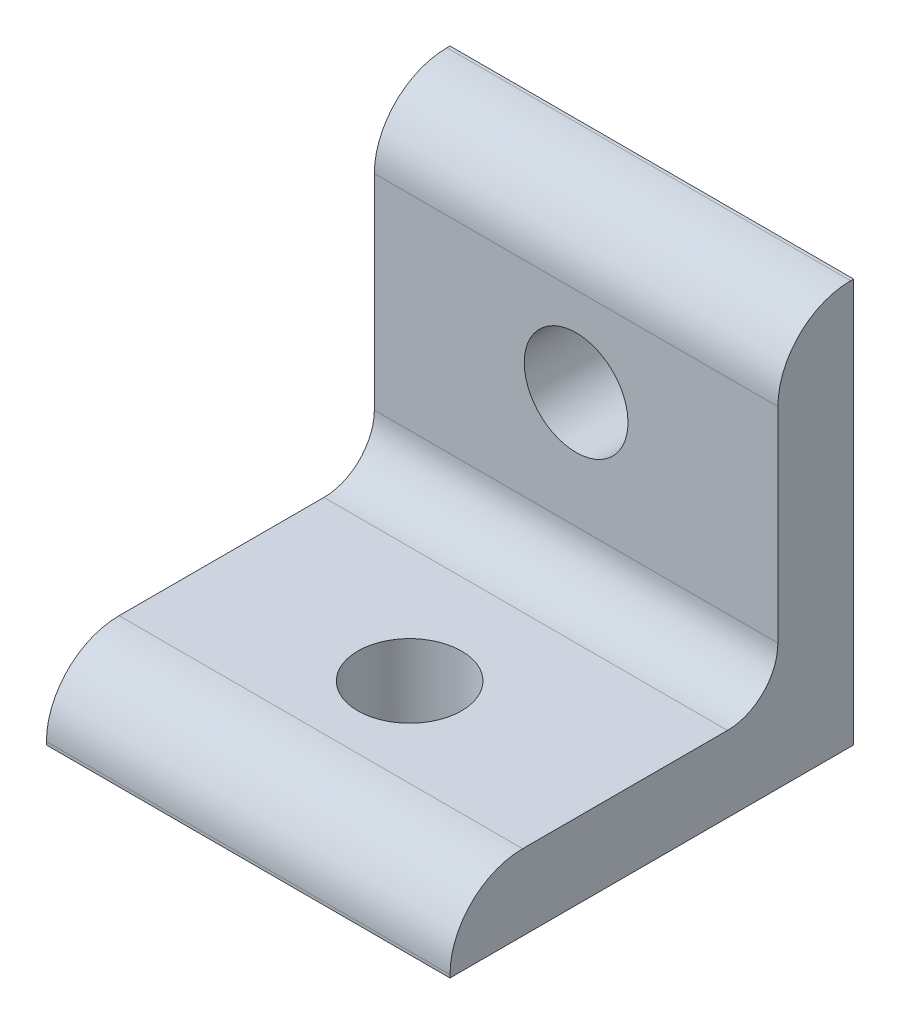
ISO-10303-21;
HEADER;
FILE_DESCRIPTION(('STEP AP214'),'2;1');
FILE_NAME('part.step','',(''),(''),'','','');
FILE_SCHEMA(('AUTOMOTIVE_DESIGN { 1 0 10303 214 1 1 1 1 }'));
ENDSEC;
DATA;
#1=APPLICATION_CONTEXT('core data for automotive mechanical design processes');
#2=APPLICATION_PROTOCOL_DEFINITION('international standard','automotive_design',2000,#1);
#3=PRODUCT_CONTEXT('',#1,'mechanical');
#4=PRODUCT('Part','Part','',(#3));
#5=PRODUCT_RELATED_PRODUCT_CATEGORY('part','',(#4));
#6=PRODUCT_DEFINITION_FORMATION('','',#4);
#7=PRODUCT_DEFINITION_CONTEXT('part definition',#1,'design');
#8=PRODUCT_DEFINITION('design','',#6,#7);
#9=PRODUCT_DEFINITION_SHAPE('','',#8);
#10=(LENGTH_UNIT() NAMED_UNIT(*) SI_UNIT(.MILLI.,.METRE.));
#11=(NAMED_UNIT(*) PLANE_ANGLE_UNIT() SI_UNIT($,.RADIAN.));
#12=(NAMED_UNIT(*) SI_UNIT($,.STERADIAN.) SOLID_ANGLE_UNIT());
#13=UNCERTAINTY_MEASURE_WITH_UNIT(LENGTH_MEASURE(1.E-05),#10,'distance_accuracy_value','');
#14=(GEOMETRIC_REPRESENTATION_CONTEXT(3) GLOBAL_UNCERTAINTY_ASSIGNED_CONTEXT((#13)) GLOBAL_UNIT_ASSIGNED_CONTEXT((#10,
#11,#12)) REPRESENTATION_CONTEXT('',''));
#15=CARTESIAN_POINT('',(0.,0.,0.));
#16=DIRECTION('',(0.,0.,1.));
#17=DIRECTION('',(1.,0.,0.));
#18=AXIS2_PLACEMENT_3D('',#15,#16,#17);
#19=CARTESIAN_POINT('',(25.4,25.4,0.));
#20=DIRECTION('',(0.,0.,-1.));
#21=DIRECTION('',(-1.,0.,0.));
#22=AXIS2_PLACEMENT_3D('',#19,#20,#21);
#23=PLANE('',#22);
#24=CARTESIAN_POINT('',(12.7,15.24,0.));
#25=DIRECTION('',(0.,0.,-1.));
#26=DIRECTION('',(-1.,0.,0.));
#27=AXIS2_PLACEMENT_3D('',#24,#25,#26);
#28=CIRCLE('',#27,3.2639);
#29=CARTESIAN_POINT('',(9.4361,15.24,0.));
#30=VERTEX_POINT('',#29);
#31=EDGE_CURVE('E219',#30,#30,#28,.T.);
#32=ORIENTED_EDGE('',*,*,#31,.F.);
#33=EDGE_LOOP('',(#32));
#34=FACE_BOUND('',#33,.T.);
#35=DIRECTION('',(0.,-1.,0.));
#36=VECTOR('',#35,1.);
#37=CARTESIAN_POINT('',(0.,25.4,0.));
#38=LINE('',#37,#36);
#39=CARTESIAN_POINT('',(0.,25.4,0.));
#40=VERTEX_POINT('',#39);
#41=CARTESIAN_POINT('',(0.,0.,0.));
#42=VERTEX_POINT('',#41);
#43=EDGE_CURVE('E139',#40,#42,#38,.T.);
#44=ORIENTED_EDGE('',*,*,#43,.F.);
#45=DIRECTION('',(-1.,0.,0.));
#46=VECTOR('',#45,1.);
#47=CARTESIAN_POINT('',(25.4,25.4,0.));
#48=LINE('',#47,#46);
#49=CARTESIAN_POINT('',(25.4,25.4,0.));
#50=VERTEX_POINT('',#49);
#51=EDGE_CURVE('E11',#50,#40,#48,.T.);
#52=ORIENTED_EDGE('',*,*,#51,.F.);
#53=DIRECTION('',(0.,-1.,0.));
#54=VECTOR('',#53,1.);
#55=CARTESIAN_POINT('',(25.4,25.4,0.));
#56=LINE('',#55,#54);
#57=CARTESIAN_POINT('',(25.4,0.,0.));
#58=VERTEX_POINT('',#57);
#59=EDGE_CURVE('E163',#50,#58,#56,.T.);
#60=ORIENTED_EDGE('',*,*,#59,.T.);
#61=DIRECTION('',(-1.,0.,0.));
#62=VECTOR('',#61,1.);
#63=CARTESIAN_POINT('',(25.4,0.,0.));
#64=LINE('',#63,#62);
#65=EDGE_CURVE('E39',#58,#42,#64,.T.);
#66=ORIENTED_EDGE('',*,*,#65,.T.);
#67=EDGE_LOOP('',(#44,#52,#60,#66));
#68=FACE_BOUND('',#67,.T.);
#69=ADVANCED_FACE('F36',(#34,#68),#23,.T.);
#70=CARTESIAN_POINT('',(25.4,25.4,0.));
#71=DIRECTION('',(0.,1.,0.));
#72=DIRECTION('',(0.,0.,1.));
#73=AXIS2_PLACEMENT_3D('',#70,#71,#72);
#74=PLANE('',#73);
#75=DIRECTION('',(0.,0.,-1.));
#76=VECTOR('',#75,1.);
#77=CARTESIAN_POINT('',(0.,25.4,0.));
#78=LINE('',#77,#76);
#79=CARTESIAN_POINT('',(0.,25.4,0.190499999999996));
#80=VERTEX_POINT('',#79);
#81=EDGE_CURVE('E161',#80,#40,#78,.T.);
#82=ORIENTED_EDGE('',*,*,#81,.F.);
#83=DIRECTION('',(-1.,0.,0.));
#84=VECTOR('',#83,1.);
#85=CARTESIAN_POINT('',(25.4,25.4,0.190499999999996));
#86=LINE('',#85,#84);
#87=CARTESIAN_POINT('',(25.4,25.4,0.190499999999996));
#88=VERTEX_POINT('',#87);
#89=EDGE_CURVE('E45',#88,#80,#86,.T.);
#90=ORIENTED_EDGE('',*,*,#89,.F.);
#91=DIRECTION('',(0.,0.,-1.));
#92=VECTOR('',#91,1.);
#93=CARTESIAN_POINT('',(25.4,25.4,0.));
#94=LINE('',#93,#92);
#95=EDGE_CURVE('E129',#88,#50,#94,.T.);
#96=ORIENTED_EDGE('',*,*,#95,.T.);
#97=ORIENTED_EDGE('',*,*,#51,.T.);
#98=EDGE_LOOP('',(#82,#90,#96,#97));
#99=FACE_BOUND('',#98,.T.);
#100=ADVANCED_FACE('F177',(#99),#74,.T.);
#101=CARTESIAN_POINT('',(25.4,20.828,0.190499999999996));
#102=DIRECTION('',(-1.,0.,0.));
#103=DIRECTION('',(0.,0.,1.));
#104=AXIS2_PLACEMENT_3D('',#101,#102,#103);
#105=CYLINDRICAL_SURFACE('',#104,4.572);
#106=CARTESIAN_POINT('',(0.,20.828,0.190499999999996));
#107=DIRECTION('',(-1.,0.,0.));
#108=DIRECTION('',(0.,0.,1.));
#109=AXIS2_PLACEMENT_3D('',#106,#107,#108);
#110=CIRCLE('',#109,4.572);
#111=CARTESIAN_POINT('',(0.,20.828,4.7625));
#112=VERTEX_POINT('',#111);
#113=EDGE_CURVE('E116',#112,#80,#110,.T.);
#114=ORIENTED_EDGE('',*,*,#113,.F.);
#115=DIRECTION('',(-1.,0.,0.));
#116=VECTOR('',#115,1.);
#117=CARTESIAN_POINT('',(25.4,20.828,4.7625));
#118=LINE('',#117,#116);
#119=CARTESIAN_POINT('',(25.4,20.828,4.7625));
#120=VERTEX_POINT('',#119);
#121=EDGE_CURVE('E111',#120,#112,#118,.T.);
#122=ORIENTED_EDGE('',*,*,#121,.F.);
#123=CARTESIAN_POINT('',(25.4,20.828,0.190499999999996));
#124=DIRECTION('',(-1.,0.,0.));
#125=DIRECTION('',(0.,0.,1.));
#126=AXIS2_PLACEMENT_3D('',#123,#124,#125);
#127=CIRCLE('',#126,4.572);
#128=EDGE_CURVE('E114',#120,#88,#127,.T.);
#129=ORIENTED_EDGE('',*,*,#128,.T.);
#130=ORIENTED_EDGE('',*,*,#89,.T.);
#131=EDGE_LOOP('',(#114,#122,#129,#130));
#132=FACE_BOUND('',#131,.T.);
#133=ADVANCED_FACE('F113',(#132),#105,.T.);
#134=CARTESIAN_POINT('',(25.4,7.9375,4.7625));
#135=DIRECTION('',(0.,0.,1.));
#136=DIRECTION('',(0.,-1.,0.));
#137=AXIS2_PLACEMENT_3D('',#134,#135,#136);
#138=PLANE('',#137);
#139=CARTESIAN_POINT('',(12.7,15.24,4.7625));
#140=DIRECTION('',(0.,0.,1.));
#141=DIRECTION('',(0.,-1.,0.));
#142=AXIS2_PLACEMENT_3D('',#139,#140,#141);
#143=CIRCLE('',#142,3.2639);
#144=CARTESIAN_POINT('',(12.7,11.9761,4.7625));
#145=VERTEX_POINT('',#144);
#146=EDGE_CURVE('E143',#145,#145,#143,.T.);
#147=ORIENTED_EDGE('',*,*,#146,.F.);
#148=EDGE_LOOP('',(#147));
#149=FACE_BOUND('',#148,.T.);
#150=DIRECTION('',(0.,1.,0.));
#151=VECTOR('',#150,1.);
#152=CARTESIAN_POINT('',(0.,7.9375,4.7625));
#153=LINE('',#152,#151);
#154=CARTESIAN_POINT('',(0.,7.9375,4.7625));
#155=VERTEX_POINT('',#154);
#156=EDGE_CURVE('E158',#155,#112,#153,.T.);
#157=ORIENTED_EDGE('',*,*,#156,.F.);
#158=DIRECTION('',(-1.,0.,0.));
#159=VECTOR('',#158,1.);
#160=CARTESIAN_POINT('',(25.4,7.9375,4.7625));
#161=LINE('',#160,#159);
#162=CARTESIAN_POINT('',(25.4,7.9375,4.7625));
#163=VERTEX_POINT('',#162);
#164=EDGE_CURVE('E121',#163,#155,#161,.T.);
#165=ORIENTED_EDGE('',*,*,#164,.F.);
#166=DIRECTION('',(0.,1.,0.));
#167=VECTOR('',#166,1.);
#168=CARTESIAN_POINT('',(25.4,7.9375,4.7625));
#169=LINE('',#168,#167);
#170=EDGE_CURVE('E127',#163,#120,#169,.T.);
#171=ORIENTED_EDGE('',*,*,#170,.T.);
#172=ORIENTED_EDGE('',*,*,#121,.T.);
#173=EDGE_LOOP('',(#157,#165,#171,#172));
#174=FACE_BOUND('',#173,.T.);
#175=ADVANCED_FACE('F131',(#149,#174),#138,.T.);
#176=CARTESIAN_POINT('',(25.4,7.9375,7.9375));
#177=DIRECTION('',(-1.,0.,0.));
#178=DIRECTION('',(0.,0.,1.));
#179=AXIS2_PLACEMENT_3D('',#176,#177,#178);
#180=CYLINDRICAL_SURFACE('',#179,3.175);
#181=CARTESIAN_POINT('',(0.,7.9375,7.9375));
#182=DIRECTION('',(1.,0.,0.));
#183=DIRECTION('',(0.,0.,-1.));
#184=AXIS2_PLACEMENT_3D('',#181,#182,#183);
#185=CIRCLE('',#184,3.175);
#186=CARTESIAN_POINT('',(0.,4.7625,7.9375));
#187=VERTEX_POINT('',#186);
#188=EDGE_CURVE('E155',#187,#155,#185,.T.);
#189=ORIENTED_EDGE('',*,*,#188,.F.);
#190=DIRECTION('',(-1.,0.,0.));
#191=VECTOR('',#190,1.);
#192=CARTESIAN_POINT('',(25.4,4.7625,7.9375));
#193=LINE('',#192,#191);
#194=CARTESIAN_POINT('',(25.4,4.7625,7.9375));
#195=VERTEX_POINT('',#194);
#196=EDGE_CURVE('E167',#195,#187,#193,.T.);
#197=ORIENTED_EDGE('',*,*,#196,.F.);
#198=CARTESIAN_POINT('',(25.4,7.9375,7.9375));
#199=DIRECTION('',(1.,0.,0.));
#200=DIRECTION('',(0.,0.,-1.));
#201=AXIS2_PLACEMENT_3D('',#198,#199,#200);
#202=CIRCLE('',#201,3.175);
#203=EDGE_CURVE('E132',#195,#163,#202,.T.);
#204=ORIENTED_EDGE('',*,*,#203,.T.);
#205=ORIENTED_EDGE('',*,*,#164,.T.);
#206=EDGE_LOOP('',(#189,#197,#204,#205));
#207=FACE_BOUND('',#206,.T.);
#208=ADVANCED_FACE('F191',(#207),#180,.F.);
#209=CARTESIAN_POINT('',(25.4,4.7625,20.828));
#210=DIRECTION('',(0.,1.,0.));
#211=DIRECTION('',(0.,0.,1.));
#212=AXIS2_PLACEMENT_3D('',#209,#210,#211);
#213=PLANE('',#212);
#214=CARTESIAN_POINT('',(12.7,4.7625,15.24));
#215=DIRECTION('',(0.,1.,0.));
#216=DIRECTION('',(0.,0.,1.));
#217=AXIS2_PLACEMENT_3D('',#214,#215,#216);
#218=CIRCLE('',#217,3.26389999999999);
#219=CARTESIAN_POINT('',(12.7,4.7625,18.5039));
#220=VERTEX_POINT('',#219);
#221=EDGE_CURVE('E216',#220,#220,#218,.T.);
#222=ORIENTED_EDGE('',*,*,#221,.F.);
#223=EDGE_LOOP('',(#222));
#224=FACE_BOUND('',#223,.T.);
#225=DIRECTION('',(0.,0.,-1.));
#226=VECTOR('',#225,1.);
#227=CARTESIAN_POINT('',(0.,4.7625,20.828));
#228=LINE('',#227,#226);
#229=CARTESIAN_POINT('',(0.,4.7625,20.828));
#230=VERTEX_POINT('',#229);
#231=EDGE_CURVE('E152',#230,#187,#228,.T.);
#232=ORIENTED_EDGE('',*,*,#231,.F.);
#233=DIRECTION('',(-1.,0.,0.));
#234=VECTOR('',#233,1.);
#235=CARTESIAN_POINT('',(25.4,4.7625,20.828));
#236=LINE('',#235,#234);
#237=CARTESIAN_POINT('',(25.4,4.7625,20.828));
#238=VERTEX_POINT('',#237);
#239=EDGE_CURVE('E169',#238,#230,#236,.T.);
#240=ORIENTED_EDGE('',*,*,#239,.F.);
#241=DIRECTION('',(0.,0.,-1.));
#242=VECTOR('',#241,1.);
#243=CARTESIAN_POINT('',(25.4,4.7625,20.828));
#244=LINE('',#243,#242);
#245=EDGE_CURVE('E134',#238,#195,#244,.T.);
#246=ORIENTED_EDGE('',*,*,#245,.T.);
#247=ORIENTED_EDGE('',*,*,#196,.T.);
#248=EDGE_LOOP('',(#232,#240,#246,#247));
#249=FACE_BOUND('',#248,.T.);
#250=ADVANCED_FACE('F195',(#224,#249),#213,.T.);
#251=CARTESIAN_POINT('',(25.4,0.1905,20.828));
#252=DIRECTION('',(-1.,0.,0.));
#253=DIRECTION('',(0.,0.,1.));
#254=AXIS2_PLACEMENT_3D('',#251,#252,#253);
#255=CYLINDRICAL_SURFACE('',#254,4.572);
#256=CARTESIAN_POINT('',(0.,0.1905,20.828));
#257=DIRECTION('',(-1.,0.,0.));
#258=DIRECTION('',(0.,0.,-1.));
#259=AXIS2_PLACEMENT_3D('',#256,#257,#258);
#260=CIRCLE('',#259,4.572);
#261=CARTESIAN_POINT('',(0.,0.1905,25.4));
#262=VERTEX_POINT('',#261);
#263=EDGE_CURVE('E149',#262,#230,#260,.T.);
#264=ORIENTED_EDGE('',*,*,#263,.F.);
#265=DIRECTION('',(-1.,0.,0.));
#266=VECTOR('',#265,1.);
#267=CARTESIAN_POINT('',(25.4,0.1905,25.4));
#268=LINE('',#267,#266);
#269=CARTESIAN_POINT('',(25.4,0.1905,25.4));
#270=VERTEX_POINT('',#269);
#271=EDGE_CURVE('E171',#270,#262,#268,.T.);
#272=ORIENTED_EDGE('',*,*,#271,.F.);
#273=CARTESIAN_POINT('',(25.4,0.1905,20.828));
#274=DIRECTION('',(-1.,0.,0.));
#275=DIRECTION('',(0.,0.,-1.));
#276=AXIS2_PLACEMENT_3D('',#273,#274,#275);
#277=CIRCLE('',#276,4.572);
#278=EDGE_CURVE('E232',#270,#238,#277,.T.);
#279=ORIENTED_EDGE('',*,*,#278,.T.);
#280=ORIENTED_EDGE('',*,*,#239,.T.);
#281=EDGE_LOOP('',(#264,#272,#279,#280));
#282=FACE_BOUND('',#281,.T.);
#283=ADVANCED_FACE('F199',(#282),#255,.T.);
#284=CARTESIAN_POINT('',(25.4,0.,25.4));
#285=DIRECTION('',(0.,0.,1.));
#286=DIRECTION('',(0.,-1.,0.));
#287=AXIS2_PLACEMENT_3D('',#284,#285,#286);
#288=PLANE('',#287);
#289=DIRECTION('',(0.,1.,0.));
#290=VECTOR('',#289,1.);
#291=CARTESIAN_POINT('',(0.,0.,25.4));
#292=LINE('',#291,#290);
#293=CARTESIAN_POINT('',(0.,0.,25.4));
#294=VERTEX_POINT('',#293);
#295=EDGE_CURVE('E146',#294,#262,#292,.T.);
#296=ORIENTED_EDGE('',*,*,#295,.F.);
#297=DIRECTION('',(-1.,0.,0.));
#298=VECTOR('',#297,1.);
#299=CARTESIAN_POINT('',(25.4,0.,25.4));
#300=LINE('',#299,#298);
#301=CARTESIAN_POINT('',(25.4,0.,25.4));
#302=VERTEX_POINT('',#301);
#303=EDGE_CURVE('E172',#302,#294,#300,.T.);
#304=ORIENTED_EDGE('',*,*,#303,.F.);
#305=DIRECTION('',(0.,1.,0.));
#306=VECTOR('',#305,1.);
#307=CARTESIAN_POINT('',(25.4,0.,25.4));
#308=LINE('',#307,#306);
#309=EDGE_CURVE('E229',#302,#270,#308,.T.);
#310=ORIENTED_EDGE('',*,*,#309,.T.);
#311=ORIENTED_EDGE('',*,*,#271,.T.);
#312=EDGE_LOOP('',(#296,#304,#310,#311));
#313=FACE_BOUND('',#312,.T.);
#314=ADVANCED_FACE('F203',(#313),#288,.T.);
#315=CARTESIAN_POINT('',(25.4,0.,0.));
#316=DIRECTION('',(0.,-1.,0.));
#317=DIRECTION('',(0.,0.,-1.));
#318=AXIS2_PLACEMENT_3D('',#315,#316,#317);
#319=PLANE('',#318);
#320=CARTESIAN_POINT('',(12.7,0.,15.24));
#321=DIRECTION('',(0.,-1.,0.));
#322=DIRECTION('',(0.,0.,-1.));
#323=AXIS2_PLACEMENT_3D('',#320,#321,#322);
#324=CIRCLE('',#323,3.26389999999999);
#325=CARTESIAN_POINT('',(12.7,0.,11.9761));
#326=VERTEX_POINT('',#325);
#327=EDGE_CURVE('E214',#326,#326,#324,.T.);
#328=ORIENTED_EDGE('',*,*,#327,.F.);
#329=EDGE_LOOP('',(#328));
#330=FACE_BOUND('',#329,.T.);
#331=DIRECTION('',(0.,0.,1.));
#332=VECTOR('',#331,1.);
#333=CARTESIAN_POINT('',(0.,0.,0.));
#334=LINE('',#333,#332);
#335=EDGE_CURVE('E142',#42,#294,#334,.T.);
#336=ORIENTED_EDGE('',*,*,#335,.F.);
#337=ORIENTED_EDGE('',*,*,#65,.F.);
#338=DIRECTION('',(0.,0.,1.));
#339=VECTOR('',#338,1.);
#340=CARTESIAN_POINT('',(25.4,0.,0.));
#341=LINE('',#340,#339);
#342=EDGE_CURVE('E227',#58,#302,#341,.T.);
#343=ORIENTED_EDGE('',*,*,#342,.T.);
#344=ORIENTED_EDGE('',*,*,#303,.T.);
#345=EDGE_LOOP('',(#336,#337,#343,#344));
#346=FACE_BOUND('',#345,.T.);
#347=ADVANCED_FACE('F174',(#330,#346),#319,.T.);
#348=CARTESIAN_POINT('',(25.4,0.1905,20.828));
#349=DIRECTION('',(1.,0.,0.));
#350=DIRECTION('',(0.,0.,-1.));
#351=AXIS2_PLACEMENT_3D('',#348,#349,#350);
#352=PLANE('',#351);
#353=ORIENTED_EDGE('',*,*,#59,.F.);
#354=ORIENTED_EDGE('',*,*,#95,.F.);
#355=ORIENTED_EDGE('',*,*,#128,.F.);
#356=ORIENTED_EDGE('',*,*,#170,.F.);
#357=ORIENTED_EDGE('',*,*,#203,.F.);
#358=ORIENTED_EDGE('',*,*,#245,.F.);
#359=ORIENTED_EDGE('',*,*,#278,.F.);
#360=ORIENTED_EDGE('',*,*,#309,.F.);
#361=ORIENTED_EDGE('',*,*,#342,.F.);
#362=EDGE_LOOP('',(#353,#354,#355,#356,#357,#358,#359,#360,#361));
#363=FACE_BOUND('',#362,.T.);
#364=ADVANCED_FACE('F125',(#363),#352,.T.);
#365=CARTESIAN_POINT('',(0.,0.1905,20.828));
#366=DIRECTION('',(1.,0.,0.));
#367=DIRECTION('',(0.,0.,-1.));
#368=AXIS2_PLACEMENT_3D('',#365,#366,#367);
#369=PLANE('',#368);
#370=ORIENTED_EDGE('',*,*,#43,.T.);
#371=ORIENTED_EDGE('',*,*,#335,.T.);
#372=ORIENTED_EDGE('',*,*,#295,.T.);
#373=ORIENTED_EDGE('',*,*,#263,.T.);
#374=ORIENTED_EDGE('',*,*,#231,.T.);
#375=ORIENTED_EDGE('',*,*,#188,.T.);
#376=ORIENTED_EDGE('',*,*,#156,.T.);
#377=ORIENTED_EDGE('',*,*,#113,.T.);
#378=ORIENTED_EDGE('',*,*,#81,.T.);
#379=EDGE_LOOP('',(#370,#371,#372,#373,#374,#375,#376,#377,#378));
#380=FACE_BOUND('',#379,.T.);
#381=ADVANCED_FACE('F176',(#380),#369,.F.);
#382=CARTESIAN_POINT('',(12.7,15.24,0.));
#383=DIRECTION('',(0.,0.,-1.));
#384=DIRECTION('',(-1.,0.,0.));
#385=AXIS2_PLACEMENT_3D('',#382,#383,#384);
#386=CYLINDRICAL_SURFACE('',#385,3.2639);
#387=ORIENTED_EDGE('',*,*,#146,.T.);
#388=EDGE_LOOP('',(#387));
#389=FACE_BOUND('',#388,.T.);
#390=ORIENTED_EDGE('',*,*,#31,.T.);
#391=EDGE_LOOP('',(#390));
#392=FACE_BOUND('',#391,.T.);
#393=ADVANCED_FACE('F244',(#389,#392),#386,.F.);
#394=CARTESIAN_POINT('',(12.7,0.,15.24));
#395=DIRECTION('',(0.,-1.,0.));
#396=DIRECTION('',(0.,0.,-1.));
#397=AXIS2_PLACEMENT_3D('',#394,#395,#396);
#398=CYLINDRICAL_SURFACE('',#397,3.26389999999999);
#399=ORIENTED_EDGE('',*,*,#221,.T.);
#400=EDGE_LOOP('',(#399));
#401=FACE_BOUND('',#400,.T.);
#402=ORIENTED_EDGE('',*,*,#327,.T.);
#403=EDGE_LOOP('',(#402));
#404=FACE_BOUND('',#403,.T.);
#405=ADVANCED_FACE('F247',(#401,#404),#398,.F.);
#406=CLOSED_SHELL('',(#69,#100,#133,#175,#208,#250,#283,#314,#347,#364,#381,#393,#405));
#407=MANIFOLD_SOLID_BREP('B2',#406);
#408=ADVANCED_BREP_SHAPE_REPRESENTATION('',(#18,#407),#14);
#409=SHAPE_DEFINITION_REPRESENTATION(#9,#408);
ENDSEC;
END-ISO-10303-21;
